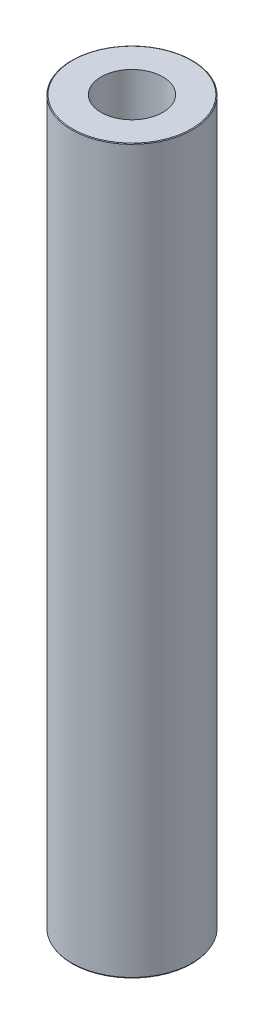
ISO-10303-21;
HEADER;
FILE_DESCRIPTION(('STEP AP214'),'2;1');
FILE_NAME('part.step','',(''),(''),'','','');
FILE_SCHEMA(('AUTOMOTIVE_DESIGN { 1 0 10303 214 1 1 1 1 }'));
ENDSEC;
DATA;
#1=APPLICATION_CONTEXT('core data for automotive mechanical design processes');
#2=APPLICATION_PROTOCOL_DEFINITION('international standard','automotive_design',2000,#1);
#3=PRODUCT_CONTEXT('',#1,'mechanical');
#4=PRODUCT('Part','Part','',(#3));
#5=PRODUCT_RELATED_PRODUCT_CATEGORY('part','',(#4));
#6=PRODUCT_DEFINITION_FORMATION('','',#4);
#7=PRODUCT_DEFINITION_CONTEXT('part definition',#1,'design');
#8=PRODUCT_DEFINITION('design','',#6,#7);
#9=PRODUCT_DEFINITION_SHAPE('','',#8);
#10=(LENGTH_UNIT() NAMED_UNIT(*) SI_UNIT(.MILLI.,.METRE.));
#11=(NAMED_UNIT(*) PLANE_ANGLE_UNIT() SI_UNIT($,.RADIAN.));
#12=(NAMED_UNIT(*) SI_UNIT($,.STERADIAN.) SOLID_ANGLE_UNIT());
#13=UNCERTAINTY_MEASURE_WITH_UNIT(LENGTH_MEASURE(1.E-05),#10,'distance_accuracy_value','');
#14=(GEOMETRIC_REPRESENTATION_CONTEXT(3) GLOBAL_UNCERTAINTY_ASSIGNED_CONTEXT((#13)) GLOBAL_UNIT_ASSIGNED_CONTEXT((#10,
#11,#12)) REPRESENTATION_CONTEXT('',''));
#15=CARTESIAN_POINT('',(0.,0.,0.));
#16=DIRECTION('',(0.,0.,1.));
#17=DIRECTION('',(1.,0.,0.));
#18=AXIS2_PLACEMENT_3D('',#15,#16,#17);
#19=CARTESIAN_POINT('',(0.,600.,0.));
#20=DIRECTION('',(0.,-1.,0.));
#21=DIRECTION('',(0.,0.,-1.));
#22=AXIS2_PLACEMENT_3D('',#19,#20,#21);
#23=CYLINDRICAL_SURFACE('',#22,50.);
#24=CARTESIAN_POINT('',(0.,599.60231545313,0.));
#25=DIRECTION('',(0.,1.,0.));
#26=DIRECTION('',(0.,0.,1.));
#27=AXIS2_PLACEMENT_3D('',#24,#25,#26);
#28=CIRCLE('',#27,50.);
#29=CARTESIAN_POINT('',(0.,599.60231545313,50.));
#30=VERTEX_POINT('',#29);
#31=EDGE_CURVE('E50',#30,#30,#28,.F.);
#32=ORIENTED_EDGE('',*,*,#31,.T.);
#33=EDGE_LOOP('',(#32));
#34=FACE_BOUND('',#33,.T.);
#35=CARTESIAN_POINT('',(0.,0.688809840564075,0.));
#36=DIRECTION('',(0.,1.,0.));
#37=DIRECTION('',(0.,0.,1.));
#38=AXIS2_PLACEMENT_3D('',#35,#36,#37);
#39=CIRCLE('',#38,50.);
#40=CARTESIAN_POINT('',(0.,0.688809840564075,50.));
#41=VERTEX_POINT('',#40);
#42=EDGE_CURVE('E51',#41,#41,#39,.T.);
#43=ORIENTED_EDGE('',*,*,#42,.T.);
#44=EDGE_LOOP('',(#43));
#45=FACE_BOUND('',#44,.T.);
#46=ADVANCED_FACE('F39',(#34,#45),#23,.T.);
#47=CARTESIAN_POINT('',(0.,600.,0.));
#48=DIRECTION('',(0.,1.,0.));
#49=DIRECTION('',(0.,0.,1.));
#50=AXIS2_PLACEMENT_3D('',#47,#48,#49);
#51=PLANE('',#50);
#52=CARTESIAN_POINT('',(0.,600.,0.));
#53=DIRECTION('',(0.,1.,0.));
#54=DIRECTION('',(0.,0.,1.));
#55=AXIS2_PLACEMENT_3D('',#52,#53,#54);
#56=CIRCLE('',#55,49.3111901594357);
#57=CARTESIAN_POINT('',(0.,600.,49.3111901594357));
#58=VERTEX_POINT('',#57);
#59=EDGE_CURVE('E54',#58,#58,#56,.T.);
#60=ORIENTED_EDGE('',*,*,#59,.T.);
#61=EDGE_LOOP('',(#60));
#62=FACE_BOUND('',#61,.T.);
#63=CARTESIAN_POINT('',(0.,600.,0.));
#64=DIRECTION('',(0.,1.,0.));
#65=DIRECTION('',(0.,0.,1.));
#66=AXIS2_PLACEMENT_3D('',#63,#64,#65);
#67=CIRCLE('',#66,25.6155666613382);
#68=CARTESIAN_POINT('',(0.,600.,25.6155666613382));
#69=VERTEX_POINT('',#68);
#70=EDGE_CURVE('E58',#69,#69,#67,.T.);
#71=ORIENTED_EDGE('',*,*,#70,.F.);
#72=EDGE_LOOP('',(#71));
#73=FACE_BOUND('',#72,.T.);
#74=ADVANCED_FACE('F69',(#62,#73),#51,.T.);
#75=CARTESIAN_POINT('',(0.,0.,0.));
#76=DIRECTION('',(0.,1.,0.));
#77=DIRECTION('',(0.,0.,1.));
#78=AXIS2_PLACEMENT_3D('',#75,#76,#77);
#79=PLANE('',#78);
#80=CARTESIAN_POINT('',(0.,0.,0.));
#81=DIRECTION('',(0.,1.,0.));
#82=DIRECTION('',(0.,0.,1.));
#83=AXIS2_PLACEMENT_3D('',#80,#81,#82);
#84=CIRCLE('',#83,49.6023154531299);
#85=CARTESIAN_POINT('',(0.,0.,49.6023154531299));
#86=VERTEX_POINT('',#85);
#87=EDGE_CURVE('E10',#86,#86,#84,.F.);
#88=ORIENTED_EDGE('',*,*,#87,.T.);
#89=EDGE_LOOP('',(#88));
#90=FACE_BOUND('',#89,.T.);
#91=CARTESIAN_POINT('',(0.,0.,0.));
#92=DIRECTION('',(0.,1.,0.));
#93=DIRECTION('',(0.,0.,1.));
#94=AXIS2_PLACEMENT_3D('',#91,#92,#93);
#95=CIRCLE('',#94,25.6155666613382);
#96=CARTESIAN_POINT('',(0.,0.,25.6155666613382));
#97=VERTEX_POINT('',#96);
#98=EDGE_CURVE('E63',#97,#97,#95,.T.);
#99=ORIENTED_EDGE('',*,*,#98,.T.);
#100=EDGE_LOOP('',(#99));
#101=FACE_BOUND('',#100,.T.);
#102=ADVANCED_FACE('F75',(#90,#101),#79,.F.);
#103=CARTESIAN_POINT('',(0.,600.,0.));
#104=DIRECTION('',(0.,-1.,0.));
#105=DIRECTION('',(0.,0.,-1.));
#106=AXIS2_PLACEMENT_3D('',#103,#104,#105);
#107=CYLINDRICAL_SURFACE('',#106,25.6155666613382);
#108=ORIENTED_EDGE('',*,*,#70,.T.);
#109=EDGE_LOOP('',(#108));
#110=FACE_BOUND('',#109,.T.);
#111=ORIENTED_EDGE('',*,*,#98,.F.);
#112=EDGE_LOOP('',(#111));
#113=FACE_BOUND('',#112,.T.);
#114=ADVANCED_FACE('F70',(#110,#113),#107,.F.);
#115=CARTESIAN_POINT('',(0.,600.,0.));
#116=DIRECTION('',(0.,-1.,0.));
#117=DIRECTION('',(0.,0.,-1.));
#118=AXIS2_PLACEMENT_3D('',#115,#116,#117);
#119=CONICAL_SURFACE('',#118,49.3111901594357,1.04719755119667);
#120=ORIENTED_EDGE('',*,*,#31,.F.);
#121=EDGE_LOOP('',(#120));
#122=FACE_BOUND('',#121,.T.);
#123=ORIENTED_EDGE('',*,*,#59,.F.);
#124=EDGE_LOOP('',(#123));
#125=FACE_BOUND('',#124,.T.);
#126=ADVANCED_FACE('F81',(#122,#125),#119,.T.);
#127=CARTESIAN_POINT('',(0.,0.688809840564075,0.));
#128=DIRECTION('',(0.,1.,0.));
#129=DIRECTION('',(0.,0.,1.));
#130=AXIS2_PLACEMENT_3D('',#127,#128,#129);
#131=CONICAL_SURFACE('',#130,50.,0.523598775598294);
#132=ORIENTED_EDGE('',*,*,#87,.F.);
#133=EDGE_LOOP('',(#132));
#134=FACE_BOUND('',#133,.T.);
#135=ORIENTED_EDGE('',*,*,#42,.F.);
#136=EDGE_LOOP('',(#135));
#137=FACE_BOUND('',#136,.T.);
#138=ADVANCED_FACE('F45',(#134,#137),#131,.T.);
#139=CLOSED_SHELL('',(#46,#74,#102,#114,#126,#138));
#140=MANIFOLD_SOLID_BREP('B2',#139);
#141=ADVANCED_BREP_SHAPE_REPRESENTATION('',(#18,#140),#14);
#142=SHAPE_DEFINITION_REPRESENTATION(#9,#141);
ENDSEC;
END-ISO-10303-21;
